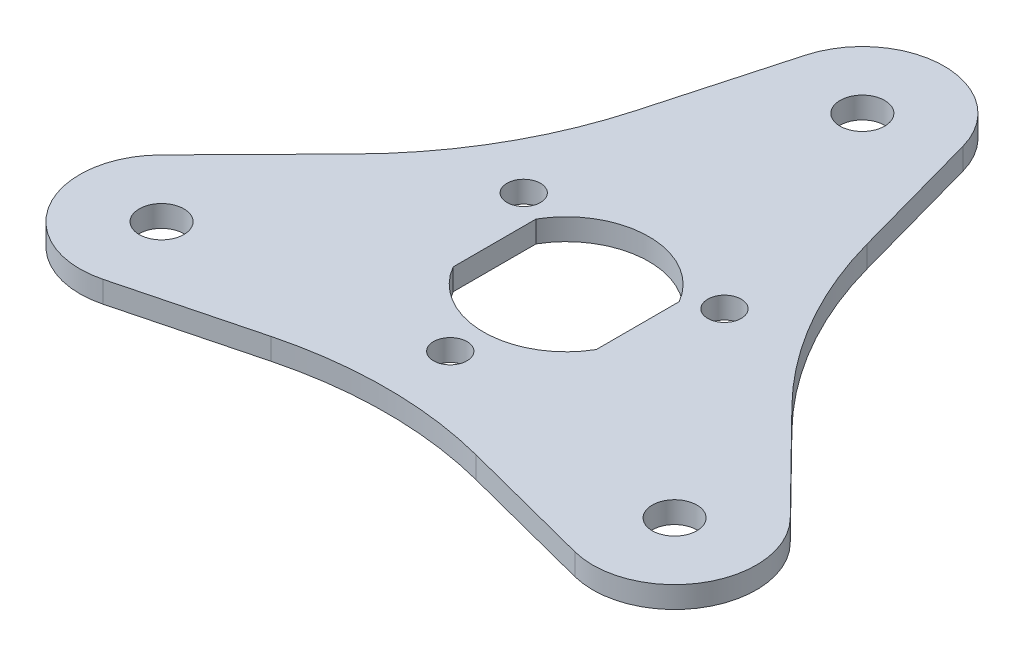
ISO-10303-21;
HEADER;
FILE_DESCRIPTION(('STEP AP214'),'2;1');
FILE_NAME('part.step','',(''),(''),'','','');
FILE_SCHEMA(('AUTOMOTIVE_DESIGN { 1 0 10303 214 1 1 1 1 }'));
ENDSEC;
DATA;
#1=APPLICATION_CONTEXT('core data for automotive mechanical design processes');
#2=APPLICATION_PROTOCOL_DEFINITION('international standard','automotive_design',2000,#1);
#3=PRODUCT_CONTEXT('',#1,'mechanical');
#4=PRODUCT('Part','Part','',(#3));
#5=PRODUCT_RELATED_PRODUCT_CATEGORY('part','',(#4));
#6=PRODUCT_DEFINITION_FORMATION('','',#4);
#7=PRODUCT_DEFINITION_CONTEXT('part definition',#1,'design');
#8=PRODUCT_DEFINITION('design','',#6,#7);
#9=PRODUCT_DEFINITION_SHAPE('','',#8);
#10=(LENGTH_UNIT() NAMED_UNIT(*) SI_UNIT(.MILLI.,.METRE.));
#11=(NAMED_UNIT(*) PLANE_ANGLE_UNIT() SI_UNIT($,.RADIAN.));
#12=(NAMED_UNIT(*) SI_UNIT($,.STERADIAN.) SOLID_ANGLE_UNIT());
#13=UNCERTAINTY_MEASURE_WITH_UNIT(LENGTH_MEASURE(1.E-05),#10,'distance_accuracy_value','');
#14=(GEOMETRIC_REPRESENTATION_CONTEXT(3) GLOBAL_UNCERTAINTY_ASSIGNED_CONTEXT((#13)) GLOBAL_UNIT_ASSIGNED_CONTEXT((#10,
#11,#12)) REPRESENTATION_CONTEXT('',''));
#15=CARTESIAN_POINT('',(0.,0.,0.));
#16=DIRECTION('',(0.,0.,1.));
#17=DIRECTION('',(1.,0.,0.));
#18=AXIS2_PLACEMENT_3D('',#15,#16,#17);
#19=CARTESIAN_POINT('',(15.4282314707645,2.9,-15.1689822139716));
#20=DIRECTION('',(-0.713072479631983,0.,0.701090321421923));
#21=DIRECTION('',(0.701090321421923,0.,0.713072479631983));
#22=AXIS2_PLACEMENT_3D('',#19,#20,#21);
#23=PLANE('',#22);
#24=DIRECTION('',(-0.701090321421924,0.,-0.713072479631983));
#25=VECTOR('',#24,1.);
#26=CARTESIAN_POINT('',(15.4282314707645,0.,-15.1689822139716));
#27=LINE('',#26,#25);
#28=CARTESIAN_POINT('',(42.3437972759519,0.,12.206590751401));
#29=VERTEX_POINT('',#28);
#30=CARTESIAN_POINT('',(29.3380366705896,0.,-1.02144803475147));
#31=VERTEX_POINT('',#30);
#32=EDGE_CURVE('E235',#29,#31,#27,.T.);
#33=ORIENTED_EDGE('',*,*,#32,.T.);
#34=DIRECTION('',(0.,-1.,0.));
#35=VECTOR('',#34,1.);
#36=CARTESIAN_POINT('',(29.3380366705896,2.9,-1.02144803475147));
#37=LINE('',#36,#35);
#38=CARTESIAN_POINT('',(29.3380366705896,2.9,-1.02144803475147));
#39=VERTEX_POINT('',#38);
#40=EDGE_CURVE('E11',#39,#31,#37,.T.);
#41=ORIENTED_EDGE('',*,*,#40,.F.);
#42=DIRECTION('',(-0.701090321421924,0.,-0.713072479631983));
#43=VECTOR('',#42,1.);
#44=CARTESIAN_POINT('',(15.4282314707645,2.9,-15.1689822139716));
#45=LINE('',#44,#43);
#46=CARTESIAN_POINT('',(42.3437972759519,2.9,12.206590751401));
#47=VERTEX_POINT('',#46);
#48=EDGE_CURVE('E469',#47,#39,#45,.T.);
#49=ORIENTED_EDGE('',*,*,#48,.F.);
#50=DIRECTION('',(0.,-1.,0.));
#51=VECTOR('',#50,1.);
#52=CARTESIAN_POINT('',(42.3437972759519,2.9,12.206590751401));
#53=LINE('',#52,#51);
#54=EDGE_CURVE('E282',#47,#29,#53,.T.);
#55=ORIENTED_EDGE('',*,*,#54,.T.);
#56=EDGE_LOOP('',(#33,#41,#49,#55));
#57=FACE_BOUND('',#56,.T.);
#58=ADVANCED_FACE('F41',(#57),#23,.F.);
#59=CARTESIAN_POINT('',(68.5570230503486,2.9,-39.5814157129573));
#60=DIRECTION('',(0.,-1.,0.));
#61=DIRECTION('',(0.,0.,-1.));
#62=AXIS2_PLACEMENT_3D('',#59,#60,#61);
#63=CYLINDRICAL_SURFACE('',#62,55.);
#64=CARTESIAN_POINT('',(68.5570230503486,0.,-39.5814157129573));
#65=DIRECTION('',(0.,1.,0.));
#66=DIRECTION('',(0.,0.,1.));
#67=AXIS2_PLACEMENT_3D('',#64,#65,#66);
#68=CIRCLE('',#67,55.);
#69=CARTESIAN_POINT('',(15.5536182820357,0.,-24.896761036514));
#70=VERTEX_POINT('',#69);
#71=EDGE_CURVE('E239',#31,#70,#68,.F.);
#72=ORIENTED_EDGE('',*,*,#71,.T.);
#73=DIRECTION('',(0.,-1.,0.));
#74=VECTOR('',#73,1.);
#75=CARTESIAN_POINT('',(15.5536182820357,2.9,-24.896761036514));
#76=LINE('',#75,#74);
#77=CARTESIAN_POINT('',(15.5536182820357,2.9,-24.896761036514));
#78=VERTEX_POINT('',#77);
#79=EDGE_CURVE('E52',#78,#70,#76,.T.);
#80=ORIENTED_EDGE('',*,*,#79,.F.);
#81=CARTESIAN_POINT('',(68.5570230503486,2.9,-39.5814157129573));
#82=DIRECTION('',(0.,1.,0.));
#83=DIRECTION('',(0.,0.,1.));
#84=AXIS2_PLACEMENT_3D('',#81,#82,#83);
#85=CIRCLE('',#84,55.);
#86=EDGE_CURVE('E471',#39,#78,#85,.F.);
#87=ORIENTED_EDGE('',*,*,#86,.F.);
#88=ORIENTED_EDGE('',*,*,#40,.T.);
#89=EDGE_LOOP('',(#72,#80,#87,#88));
#90=FACE_BOUND('',#89,.T.);
#91=ADVANCED_FACE('F355',(#90),#63,.F.);
#92=CARTESIAN_POINT('',(20.8508396822361,2.9,-5.77674928216247));
#93=DIRECTION('',(-0.963698268514779,0.,0.266993721389879));
#94=DIRECTION('',(0.266993721389879,0.,0.963698268514779));
#95=AXIS2_PLACEMENT_3D('',#92,#93,#94);
#96=PLANE('',#95);
#97=DIRECTION('',(-0.266993721389879,0.,-0.963698268514779));
#98=VECTOR('',#97,1.);
#99=CARTESIAN_POINT('',(20.8508396822361,0.,-5.77674928216247));
#100=LINE('',#99,#98);
#101=CARTESIAN_POINT('',(10.6006809536628,0.,-42.7740995093728));
#102=VERTEX_POINT('',#101);
#103=EDGE_CURVE('E242',#70,#102,#100,.T.);
#104=ORIENTED_EDGE('',*,*,#103,.T.);
#105=DIRECTION('',(0.,-1.,0.));
#106=VECTOR('',#105,1.);
#107=CARTESIAN_POINT('',(10.6006809536628,2.9,-42.7740995093728));
#108=LINE('',#107,#106);
#109=CARTESIAN_POINT('',(10.6006809536628,2.9,-42.7740995093728));
#110=VERTEX_POINT('',#109);
#111=EDGE_CURVE('E309',#110,#102,#108,.T.);
#112=ORIENTED_EDGE('',*,*,#111,.F.);
#113=DIRECTION('',(-0.266993721389879,0.,-0.963698268514779));
#114=VECTOR('',#113,1.);
#115=CARTESIAN_POINT('',(20.8508396822361,2.9,-5.77674928216247));
#116=LINE('',#115,#114);
#117=EDGE_CURVE('E476',#78,#110,#116,.T.);
#118=ORIENTED_EDGE('',*,*,#117,.F.);
#119=ORIENTED_EDGE('',*,*,#79,.T.);
#120=EDGE_LOOP('',(#104,#112,#118,#119));
#121=FACE_BOUND('',#120,.T.);
#122=ADVANCED_FACE('F361',(#121),#96,.F.);
#123=CARTESIAN_POINT('',(0.,2.9,-39.8371685740843));
#124=DIRECTION('',(0.,-1.,0.));
#125=DIRECTION('',(0.,0.,-1.));
#126=AXIS2_PLACEMENT_3D('',#123,#124,#125);
#127=CYLINDRICAL_SURFACE('',#126,11.);
#128=CARTESIAN_POINT('',(0.,0.,-39.8371685740843));
#129=DIRECTION('',(0.,1.,0.));
#130=DIRECTION('',(0.,0.,1.));
#131=AXIS2_PLACEMENT_3D('',#128,#129,#130);
#132=CIRCLE('',#131,11.);
#133=CARTESIAN_POINT('',(-10.6006809536624,0.,-42.774099509373));
#134=VERTEX_POINT('',#133);
#135=EDGE_CURVE('E245',#102,#134,#132,.T.);
#136=ORIENTED_EDGE('',*,*,#135,.T.);
#137=DIRECTION('',(0.,-1.,0.));
#138=VECTOR('',#137,1.);
#139=CARTESIAN_POINT('',(-10.6006809536624,2.9,-42.774099509373));
#140=LINE('',#139,#138);
#141=CARTESIAN_POINT('',(-10.6006809536624,2.9,-42.774099509373));
#142=VERTEX_POINT('',#141);
#143=EDGE_CURVE('E305',#142,#134,#140,.T.);
#144=ORIENTED_EDGE('',*,*,#143,.F.);
#145=CARTESIAN_POINT('',(0.,2.9,-39.8371685740843));
#146=DIRECTION('',(0.,1.,0.));
#147=DIRECTION('',(0.,0.,1.));
#148=AXIS2_PLACEMENT_3D('',#145,#146,#147);
#149=CIRCLE('',#148,11.);
#150=EDGE_CURVE('E437',#110,#142,#149,.T.);
#151=ORIENTED_EDGE('',*,*,#150,.F.);
#152=ORIENTED_EDGE('',*,*,#111,.T.);
#153=EDGE_LOOP('',(#136,#144,#151,#152));
#154=FACE_BOUND('',#153,.T.);
#155=ADVANCED_FACE('F421',(#154),#127,.T.);
#156=CARTESIAN_POINT('',(-20.850839682236,2.9,-5.77674928216277));
#157=DIRECTION('',(0.963698268514776,0.,0.266993721389892));
#158=DIRECTION('',(0.266993721389892,0.,-0.963698268514776));
#159=AXIS2_PLACEMENT_3D('',#156,#157,#158);
#160=PLANE('',#159);
#161=DIRECTION('',(-0.266993721389892,0.,0.963698268514776));
#162=VECTOR('',#161,1.);
#163=CARTESIAN_POINT('',(-20.850839682236,0.,-5.77674928216277));
#164=LINE('',#163,#162);
#165=CARTESIAN_POINT('',(-15.5536182820354,0.,-24.8967610365142));
#166=VERTEX_POINT('',#165);
#167=EDGE_CURVE('E248',#134,#166,#164,.T.);
#168=ORIENTED_EDGE('',*,*,#167,.T.);
#169=DIRECTION('',(0.,-1.,0.));
#170=VECTOR('',#169,1.);
#171=CARTESIAN_POINT('',(-15.5536182820354,2.9,-24.8967610365142));
#172=LINE('',#171,#170);
#173=CARTESIAN_POINT('',(-15.5536182820354,2.9,-24.8967610365142));
#174=VERTEX_POINT('',#173);
#175=EDGE_CURVE('E301',#174,#166,#172,.T.);
#176=ORIENTED_EDGE('',*,*,#175,.F.);
#177=DIRECTION('',(-0.266993721389892,0.,0.963698268514776));
#178=VECTOR('',#177,1.);
#179=CARTESIAN_POINT('',(-20.850839682236,2.9,-5.77674928216277));
#180=LINE('',#179,#178);
#181=EDGE_CURVE('E451',#142,#174,#180,.T.);
#182=ORIENTED_EDGE('',*,*,#181,.F.);
#183=ORIENTED_EDGE('',*,*,#143,.T.);
#184=EDGE_LOOP('',(#168,#176,#182,#183));
#185=FACE_BOUND('',#184,.T.);
#186=ADVANCED_FACE('F417',(#185),#160,.F.);
#187=CARTESIAN_POINT('',(-68.557023050348,2.9,-39.5814157129582));
#188=DIRECTION('',(0.,-1.,0.));
#189=DIRECTION('',(0.,0.,-1.));
#190=AXIS2_PLACEMENT_3D('',#187,#188,#189);
#191=CYLINDRICAL_SURFACE('',#190,55.);
#192=CARTESIAN_POINT('',(-68.557023050348,0.,-39.5814157129582));
#193=DIRECTION('',(0.,1.,0.));
#194=DIRECTION('',(0.,0.,1.));
#195=AXIS2_PLACEMENT_3D('',#192,#193,#194);
#196=CIRCLE('',#195,55.);
#197=CARTESIAN_POINT('',(-29.3380366705896,0.,-1.02144803475187));
#198=VERTEX_POINT('',#197);
#199=EDGE_CURVE('E251',#166,#198,#196,.F.);
#200=ORIENTED_EDGE('',*,*,#199,.T.);
#201=DIRECTION('',(0.,-1.,0.));
#202=VECTOR('',#201,1.);
#203=CARTESIAN_POINT('',(-29.3380366705896,2.9,-1.02144803475187));
#204=LINE('',#203,#202);
#205=CARTESIAN_POINT('',(-29.3380366705896,2.9,-1.02144803475187));
#206=VERTEX_POINT('',#205);
#207=EDGE_CURVE('E297',#206,#198,#204,.T.);
#208=ORIENTED_EDGE('',*,*,#207,.F.);
#209=CARTESIAN_POINT('',(-68.557023050348,2.9,-39.5814157129582));
#210=DIRECTION('',(0.,1.,0.));
#211=DIRECTION('',(0.,0.,1.));
#212=AXIS2_PLACEMENT_3D('',#209,#210,#211);
#213=CIRCLE('',#212,55.);
#214=EDGE_CURVE('E447',#174,#206,#213,.F.);
#215=ORIENTED_EDGE('',*,*,#214,.F.);
#216=ORIENTED_EDGE('',*,*,#175,.T.);
#217=EDGE_LOOP('',(#200,#208,#215,#216));
#218=FACE_BOUND('',#217,.T.);
#219=ADVANCED_FACE('F413',(#218),#191,.F.);
#220=CARTESIAN_POINT('',(-15.4282314707643,2.9,-15.1689822139718));
#221=DIRECTION('',(0.713072479631973,0.,0.701090321421934));
#222=DIRECTION('',(0.701090321421934,0.,-0.713072479631973));
#223=AXIS2_PLACEMENT_3D('',#220,#221,#222);
#224=PLANE('',#223);
#225=DIRECTION('',(-0.701090321421934,0.,0.713072479631973));
#226=VECTOR('',#225,1.);
#227=CARTESIAN_POINT('',(-15.4282314707643,0.,-15.1689822139718));
#228=LINE('',#227,#226);
#229=CARTESIAN_POINT('',(-42.3437972759517,0.,12.2065907514008));
#230=VERTEX_POINT('',#229);
#231=EDGE_CURVE('E254',#198,#230,#228,.T.);
#232=ORIENTED_EDGE('',*,*,#231,.T.);
#233=DIRECTION('',(0.,-1.,0.));
#234=VECTOR('',#233,1.);
#235=CARTESIAN_POINT('',(-42.3437972759517,2.9,12.2065907514008));
#236=LINE('',#235,#234);
#237=CARTESIAN_POINT('',(-42.3437972759517,2.9,12.2065907514008));
#238=VERTEX_POINT('',#237);
#239=EDGE_CURVE('E293',#238,#230,#236,.T.);
#240=ORIENTED_EDGE('',*,*,#239,.F.);
#241=DIRECTION('',(-0.701090321421934,0.,0.713072479631973));
#242=VECTOR('',#241,1.);
#243=CARTESIAN_POINT('',(-15.4282314707643,2.9,-15.1689822139718));
#244=LINE('',#243,#242);
#245=EDGE_CURVE('E450',#206,#238,#244,.T.);
#246=ORIENTED_EDGE('',*,*,#245,.F.);
#247=ORIENTED_EDGE('',*,*,#207,.T.);
#248=EDGE_LOOP('',(#232,#240,#246,#247));
#249=FACE_BOUND('',#248,.T.);
#250=ADVANCED_FACE('F409',(#249),#224,.F.);
#251=CARTESIAN_POINT('',(-34.5,2.9,19.9185842870423));
#252=DIRECTION('',(0.,-1.,0.));
#253=DIRECTION('',(0.,0.,-1.));
#254=AXIS2_PLACEMENT_3D('',#251,#252,#253);
#255=CYLINDRICAL_SURFACE('',#254,11.);
#256=CARTESIAN_POINT('',(-34.5,0.,19.9185842870423));
#257=DIRECTION('',(0.,1.,0.));
#258=DIRECTION('',(0.,0.,1.));
#259=AXIS2_PLACEMENT_3D('',#256,#257,#258);
#260=CIRCLE('',#259,11.);
#261=CARTESIAN_POINT('',(-31.7431163222892,0.,30.5675087579722));
#262=VERTEX_POINT('',#261);
#263=EDGE_CURVE('E257',#230,#262,#260,.T.);
#264=ORIENTED_EDGE('',*,*,#263,.T.);
#265=DIRECTION('',(0.,-1.,0.));
#266=VECTOR('',#265,1.);
#267=CARTESIAN_POINT('',(-31.7431163222892,2.9,30.5675087579722));
#268=LINE('',#267,#266);
#269=CARTESIAN_POINT('',(-31.7431163222892,2.9,30.5675087579722));
#270=VERTEX_POINT('',#269);
#271=EDGE_CURVE('E289',#270,#262,#268,.T.);
#272=ORIENTED_EDGE('',*,*,#271,.F.);
#273=CARTESIAN_POINT('',(-34.5,2.9,19.9185842870423));
#274=DIRECTION('',(0.,1.,0.));
#275=DIRECTION('',(0.,0.,1.));
#276=AXIS2_PLACEMENT_3D('',#273,#274,#275);
#277=CIRCLE('',#276,11.);
#278=EDGE_CURVE('E455',#238,#270,#277,.T.);
#279=ORIENTED_EDGE('',*,*,#278,.F.);
#280=ORIENTED_EDGE('',*,*,#239,.T.);
#281=EDGE_LOOP('',(#264,#272,#279,#280));
#282=FACE_BOUND('',#281,.T.);
#283=ADVANCED_FACE('F405',(#282),#255,.T.);
#284=CARTESIAN_POINT('',(5.42260821147162,2.9,20.9457314961344));
#285=DIRECTION('',(-0.250625788882801,0.,-0.968084042811818));
#286=DIRECTION('',(-0.968084042811818,0.,0.250625788882801));
#287=AXIS2_PLACEMENT_3D('',#284,#285,#286);
#288=PLANE('',#287);
#289=DIRECTION('',(0.968084042811818,0.,-0.250625788882801));
#290=VECTOR('',#289,1.);
#291=CARTESIAN_POINT('',(5.42260821147162,0.,20.9457314961344));
#292=LINE('',#291,#290);
#293=CARTESIAN_POINT('',(-13.7844183885541,0.,25.9182090712659));
#294=VERTEX_POINT('',#293);
#295=EDGE_CURVE('E260',#262,#294,#292,.T.);
#296=ORIENTED_EDGE('',*,*,#295,.T.);
#297=DIRECTION('',(0.,-1.,0.));
#298=VECTOR('',#297,1.);
#299=CARTESIAN_POINT('',(-13.7844183885541,2.9,25.9182090712659));
#300=LINE('',#299,#298);
#301=CARTESIAN_POINT('',(-13.7844183885541,2.9,25.9182090712659));
#302=VERTEX_POINT('',#301);
#303=EDGE_CURVE('E184',#302,#294,#300,.T.);
#304=ORIENTED_EDGE('',*,*,#303,.F.);
#305=DIRECTION('',(0.968084042811818,0.,-0.250625788882801));
#306=VECTOR('',#305,1.);
#307=CARTESIAN_POINT('',(5.42260821147162,2.9,20.9457314961344));
#308=LINE('',#307,#306);
#309=EDGE_CURVE('E173',#270,#302,#308,.T.);
#310=ORIENTED_EDGE('',*,*,#309,.F.);
#311=ORIENTED_EDGE('',*,*,#271,.T.);
#312=EDGE_LOOP('',(#296,#304,#310,#311));
#313=FACE_BOUND('',#312,.T.);
#314=ADVANCED_FACE('F402',(#313),#288,.F.);
#315=CARTESIAN_POINT('',(0.,2.9,79.1628314259158));
#316=DIRECTION('',(0.,-1.,0.));
#317=DIRECTION('',(0.,0.,-1.));
#318=AXIS2_PLACEMENT_3D('',#315,#316,#317);
#319=CYLINDRICAL_SURFACE('',#318,55.);
#320=CARTESIAN_POINT('',(0.,0.,79.1628314259158));
#321=DIRECTION('',(0.,1.,0.));
#322=DIRECTION('',(0.,0.,1.));
#323=AXIS2_PLACEMENT_3D('',#320,#321,#322);
#324=CIRCLE('',#323,55.);
#325=CARTESIAN_POINT('',(13.7844183885541,0.,25.9182090712659));
#326=VERTEX_POINT('',#325);
#327=EDGE_CURVE('E182',#294,#326,#324,.F.);
#328=ORIENTED_EDGE('',*,*,#327,.T.);
#329=DIRECTION('',(0.,-1.,0.));
#330=VECTOR('',#329,1.);
#331=CARTESIAN_POINT('',(13.7844183885541,2.9,25.9182090712659));
#332=LINE('',#331,#330);
#333=CARTESIAN_POINT('',(13.7844183885541,2.9,25.9182090712659));
#334=VERTEX_POINT('',#333);
#335=EDGE_CURVE('E179',#334,#326,#332,.T.);
#336=ORIENTED_EDGE('',*,*,#335,.F.);
#337=CARTESIAN_POINT('',(0.,2.9,79.1628314259158));
#338=DIRECTION('',(0.,1.,0.));
#339=DIRECTION('',(0.,0.,1.));
#340=AXIS2_PLACEMENT_3D('',#337,#338,#339);
#341=CIRCLE('',#340,55.);
#342=EDGE_CURVE('E166',#302,#334,#341,.F.);
#343=ORIENTED_EDGE('',*,*,#342,.F.);
#344=ORIENTED_EDGE('',*,*,#303,.T.);
#345=EDGE_LOOP('',(#328,#336,#343,#344));
#346=FACE_BOUND('',#345,.T.);
#347=ADVANCED_FACE('F180',(#346),#319,.F.);
#348=CARTESIAN_POINT('',(-5.42260821147162,2.9,20.9457314961344));
#349=DIRECTION('',(0.250625788882801,0.,-0.968084042811818));
#350=DIRECTION('',(-0.968084042811818,0.,-0.250625788882801));
#351=AXIS2_PLACEMENT_3D('',#348,#349,#350);
#352=PLANE('',#351);
#353=DIRECTION('',(0.968084042811818,0.,0.250625788882801));
#354=VECTOR('',#353,1.);
#355=CARTESIAN_POINT('',(-5.42260821147162,0.,20.9457314961344));
#356=LINE('',#355,#354);
#357=CARTESIAN_POINT('',(31.7431163222892,0.,30.5675087579719));
#358=VERTEX_POINT('',#357);
#359=EDGE_CURVE('E114',#326,#358,#356,.T.);
#360=ORIENTED_EDGE('',*,*,#359,.T.);
#361=DIRECTION('',(0.,-1.,0.));
#362=VECTOR('',#361,1.);
#363=CARTESIAN_POINT('',(31.7431163222892,2.9,30.5675087579719));
#364=LINE('',#363,#362);
#365=CARTESIAN_POINT('',(31.7431163222892,2.9,30.5675087579719));
#366=VERTEX_POINT('',#365);
#367=EDGE_CURVE('E185',#366,#358,#364,.T.);
#368=ORIENTED_EDGE('',*,*,#367,.F.);
#369=DIRECTION('',(0.968084042811818,0.,0.250625788882801));
#370=VECTOR('',#369,1.);
#371=CARTESIAN_POINT('',(-5.42260821147162,2.9,20.9457314961344));
#372=LINE('',#371,#370);
#373=EDGE_CURVE('E171',#334,#366,#372,.T.);
#374=ORIENTED_EDGE('',*,*,#373,.F.);
#375=ORIENTED_EDGE('',*,*,#335,.T.);
#376=EDGE_LOOP('',(#360,#368,#374,#375));
#377=FACE_BOUND('',#376,.T.);
#378=ADVANCED_FACE('F187',(#377),#352,.F.);
#379=CARTESIAN_POINT('',(0.,2.9,0.));
#380=DIRECTION('',(0.,-1.,0.));
#381=DIRECTION('',(0.,0.,-1.));
#382=AXIS2_PLACEMENT_3D('',#379,#380,#381);
#383=CYLINDRICAL_SURFACE('',#382,11.125);
#384=CARTESIAN_POINT('',(0.,0.,0.));
#385=DIRECTION('',(0.,1.,0.));
#386=DIRECTION('',(0.,0.,1.));
#387=AXIS2_PLACEMENT_3D('',#384,#385,#386);
#388=CIRCLE('',#387,11.125);
#389=CARTESIAN_POINT('',(9.62500000000001,0.,-5.57897840110534));
#390=VERTEX_POINT('',#389);
#391=CARTESIAN_POINT('',(-9.62500000000001,0.,-5.57897840110534));
#392=VERTEX_POINT('',#391);
#393=EDGE_CURVE('E207',#390,#392,#388,.T.);
#394=ORIENTED_EDGE('',*,*,#393,.F.);
#395=DIRECTION('',(0.,-1.,0.));
#396=VECTOR('',#395,1.);
#397=CARTESIAN_POINT('',(9.62500000000001,2.9,-5.57897840110534));
#398=LINE('',#397,#396);
#399=CARTESIAN_POINT('',(9.62500000000001,2.9,-5.57897840110534));
#400=VERTEX_POINT('',#399);
#401=EDGE_CURVE('E45',#400,#390,#398,.T.);
#402=ORIENTED_EDGE('',*,*,#401,.F.);
#403=CARTESIAN_POINT('',(0.,2.9,0.));
#404=DIRECTION('',(0.,1.,0.));
#405=DIRECTION('',(0.,0.,1.));
#406=AXIS2_PLACEMENT_3D('',#403,#404,#405);
#407=CIRCLE('',#406,11.125);
#408=CARTESIAN_POINT('',(-9.62500000000001,2.9,-5.57897840110534));
#409=VERTEX_POINT('',#408);
#410=EDGE_CURVE('E281',#400,#409,#407,.T.);
#411=ORIENTED_EDGE('',*,*,#410,.T.);
#412=DIRECTION('',(0.,-1.,0.));
#413=VECTOR('',#412,1.);
#414=CARTESIAN_POINT('',(-9.62500000000001,2.9,-5.57897840110534));
#415=LINE('',#414,#413);
#416=EDGE_CURVE('E206',#409,#392,#415,.T.);
#417=ORIENTED_EDGE('',*,*,#416,.T.);
#418=EDGE_LOOP('',(#394,#402,#411,#417));
#419=FACE_BOUND('',#418,.T.);
#420=ADVANCED_FACE('F43',(#419),#383,.F.);
#421=CARTESIAN_POINT('',(9.62500000000001,2.9,0.));
#422=DIRECTION('',(1.,0.,0.));
#423=DIRECTION('',(0.,0.,-1.));
#424=AXIS2_PLACEMENT_3D('',#421,#422,#423);
#425=PLANE('',#424);
#426=DIRECTION('',(0.,0.,1.));
#427=VECTOR('',#426,1.);
#428=CARTESIAN_POINT('',(9.62500000000001,0.,0.));
#429=LINE('',#428,#427);
#430=CARTESIAN_POINT('',(9.62500000000001,0.,5.57897840110534));
#431=VERTEX_POINT('',#430);
#432=EDGE_CURVE('E211',#390,#431,#429,.T.);
#433=ORIENTED_EDGE('',*,*,#432,.T.);
#434=DIRECTION('',(0.,-1.,0.));
#435=VECTOR('',#434,1.);
#436=CARTESIAN_POINT('',(9.62500000000001,2.9,5.57897840110534));
#437=LINE('',#436,#435);
#438=CARTESIAN_POINT('',(9.62500000000001,2.9,5.57897840110534));
#439=VERTEX_POINT('',#438);
#440=EDGE_CURVE('E320',#439,#431,#437,.T.);
#441=ORIENTED_EDGE('',*,*,#440,.F.);
#442=DIRECTION('',(0.,0.,1.));
#443=VECTOR('',#442,1.);
#444=CARTESIAN_POINT('',(9.62500000000001,2.9,0.));
#445=LINE('',#444,#443);
#446=EDGE_CURVE('E330',#400,#439,#445,.T.);
#447=ORIENTED_EDGE('',*,*,#446,.F.);
#448=ORIENTED_EDGE('',*,*,#401,.T.);
#449=EDGE_LOOP('',(#433,#441,#447,#448));
#450=FACE_BOUND('',#449,.T.);
#451=ADVANCED_FACE('F329',(#450),#425,.F.);
#452=CARTESIAN_POINT('',(0.,2.9,0.));
#453=DIRECTION('',(0.,-1.,0.));
#454=DIRECTION('',(0.,0.,-1.));
#455=AXIS2_PLACEMENT_3D('',#452,#453,#454);
#456=CYLINDRICAL_SURFACE('',#455,11.125);
#457=CARTESIAN_POINT('',(0.,0.,0.));
#458=DIRECTION('',(0.,1.,0.));
#459=DIRECTION('',(0.,0.,1.));
#460=AXIS2_PLACEMENT_3D('',#457,#458,#459);
#461=CIRCLE('',#460,11.125);
#462=CARTESIAN_POINT('',(-9.62500000000001,0.,5.57897840110534));
#463=VERTEX_POINT('',#462);
#464=EDGE_CURVE('E215',#463,#431,#461,.T.);
#465=ORIENTED_EDGE('',*,*,#464,.F.);
#466=DIRECTION('',(0.,-1.,0.));
#467=VECTOR('',#466,1.);
#468=CARTESIAN_POINT('',(-9.62500000000001,2.9,5.57897840110534));
#469=LINE('',#468,#467);
#470=CARTESIAN_POINT('',(-9.62500000000001,2.9,5.57897840110534));
#471=VERTEX_POINT('',#470);
#472=EDGE_CURVE('E318',#471,#463,#469,.T.);
#473=ORIENTED_EDGE('',*,*,#472,.F.);
#474=CARTESIAN_POINT('',(0.,2.9,0.));
#475=DIRECTION('',(0.,1.,0.));
#476=DIRECTION('',(0.,0.,1.));
#477=AXIS2_PLACEMENT_3D('',#474,#475,#476);
#478=CIRCLE('',#477,11.125);
#479=EDGE_CURVE('E494',#471,#439,#478,.T.);
#480=ORIENTED_EDGE('',*,*,#479,.T.);
#481=ORIENTED_EDGE('',*,*,#440,.T.);
#482=EDGE_LOOP('',(#465,#473,#480,#481));
#483=FACE_BOUND('',#482,.T.);
#484=ADVANCED_FACE('F342',(#483),#456,.F.);
#485=CARTESIAN_POINT('',(-34.5,2.9,19.9185842870423));
#486=DIRECTION('',(0.,-1.,0.));
#487=DIRECTION('',(0.,0.,-1.));
#488=AXIS2_PLACEMENT_3D('',#485,#486,#487);
#489=CYLINDRICAL_SURFACE('',#488,3.);
#490=CARTESIAN_POINT('',(-34.5,2.9,19.9185842870423));
#491=DIRECTION('',(0.,1.,0.));
#492=DIRECTION('',(0.,0.,1.));
#493=AXIS2_PLACEMENT_3D('',#490,#491,#492);
#494=CIRCLE('',#493,3.);
#495=CARTESIAN_POINT('',(-34.5,2.9,22.9185842870423));
#496=VERTEX_POINT('',#495);
#497=EDGE_CURVE('E198',#496,#496,#494,.T.);
#498=ORIENTED_EDGE('',*,*,#497,.T.);
#499=EDGE_LOOP('',(#498));
#500=FACE_BOUND('',#499,.T.);
#501=CARTESIAN_POINT('',(-34.5,0.,19.9185842870423));
#502=DIRECTION('',(0.,1.,0.));
#503=DIRECTION('',(0.,0.,1.));
#504=AXIS2_PLACEMENT_3D('',#501,#502,#503);
#505=CIRCLE('',#504,3.);
#506=CARTESIAN_POINT('',(-34.5,0.,22.9185842870423));
#507=VERTEX_POINT('',#506);
#508=EDGE_CURVE('E273',#507,#507,#505,.T.);
#509=ORIENTED_EDGE('',*,*,#508,.F.);
#510=EDGE_LOOP('',(#509));
#511=FACE_BOUND('',#510,.T.);
#512=ADVANCED_FACE('F344',(#500,#511),#489,.F.);
#513=CARTESIAN_POINT('',(34.5000000000003,2.9,19.9185842870418));
#514=DIRECTION('',(0.,-1.,0.));
#515=DIRECTION('',(0.,0.,-1.));
#516=AXIS2_PLACEMENT_3D('',#513,#514,#515);
#517=CYLINDRICAL_SURFACE('',#516,3.);
#518=CARTESIAN_POINT('',(34.5000000000003,2.9,19.9185842870418));
#519=DIRECTION('',(0.,1.,0.));
#520=DIRECTION('',(0.,0.,1.));
#521=AXIS2_PLACEMENT_3D('',#518,#519,#520);
#522=CIRCLE('',#521,3.);
#523=CARTESIAN_POINT('',(34.5000000000003,2.9,22.9185842870418));
#524=VERTEX_POINT('',#523);
#525=EDGE_CURVE('E191',#524,#524,#522,.T.);
#526=ORIENTED_EDGE('',*,*,#525,.T.);
#527=EDGE_LOOP('',(#526));
#528=FACE_BOUND('',#527,.T.);
#529=CARTESIAN_POINT('',(34.5000000000003,0.,19.9185842870418));
#530=DIRECTION('',(0.,1.,0.));
#531=DIRECTION('',(0.,0.,1.));
#532=AXIS2_PLACEMENT_3D('',#529,#530,#531);
#533=CIRCLE('',#532,3.);
#534=CARTESIAN_POINT('',(34.5000000000003,0.,22.9185842870418));
#535=VERTEX_POINT('',#534);
#536=EDGE_CURVE('E269',#535,#535,#533,.T.);
#537=ORIENTED_EDGE('',*,*,#536,.F.);
#538=EDGE_LOOP('',(#537));
#539=FACE_BOUND('',#538,.T.);
#540=ADVANCED_FACE('F350',(#528,#539),#517,.F.);
#541=CARTESIAN_POINT('',(34.5000000000003,2.9,19.9185842870418));
#542=DIRECTION('',(0.,-1.,0.));
#543=DIRECTION('',(0.,0.,-1.));
#544=AXIS2_PLACEMENT_3D('',#541,#542,#543);
#545=CYLINDRICAL_SURFACE('',#544,11.);
#546=CARTESIAN_POINT('',(34.5000000000003,0.,19.9185842870418));
#547=DIRECTION('',(0.,1.,0.));
#548=DIRECTION('',(0.,0.,1.));
#549=AXIS2_PLACEMENT_3D('',#546,#547,#548);
#550=CIRCLE('',#549,11.);
#551=EDGE_CURVE('E120',#358,#29,#550,.T.);
#552=ORIENTED_EDGE('',*,*,#551,.T.);
#553=ORIENTED_EDGE('',*,*,#54,.F.);
#554=CARTESIAN_POINT('',(34.5000000000003,2.9,19.9185842870418));
#555=DIRECTION('',(0.,1.,0.));
#556=DIRECTION('',(0.,0.,1.));
#557=AXIS2_PLACEMENT_3D('',#554,#555,#556);
#558=CIRCLE('',#557,11.);
#559=EDGE_CURVE('E61',#366,#47,#558,.T.);
#560=ORIENTED_EDGE('',*,*,#559,.F.);
#561=ORIENTED_EDGE('',*,*,#367,.T.);
#562=EDGE_LOOP('',(#552,#553,#560,#561));
#563=FACE_BOUND('',#562,.T.);
#564=ADVANCED_FACE('F370',(#563),#545,.T.);
#565=CARTESIAN_POINT('',(13.5,2.9,-7.79422863405995));
#566=DIRECTION('',(0.,-1.,0.));
#567=DIRECTION('',(0.,0.,-1.));
#568=AXIS2_PLACEMENT_3D('',#565,#566,#567);
#569=CYLINDRICAL_SURFACE('',#568,2.25);
#570=CARTESIAN_POINT('',(13.5,2.9,-7.79422863405995));
#571=DIRECTION('',(0.,1.,0.));
#572=DIRECTION('',(0.,0.,1.));
#573=AXIS2_PLACEMENT_3D('',#570,#571,#572);
#574=CIRCLE('',#573,2.25);
#575=CARTESIAN_POINT('',(13.5,2.9,-5.54422863405995));
#576=VERTEX_POINT('',#575);
#577=EDGE_CURVE('E472',#576,#576,#574,.T.);
#578=ORIENTED_EDGE('',*,*,#577,.T.);
#579=EDGE_LOOP('',(#578));
#580=FACE_BOUND('',#579,.T.);
#581=CARTESIAN_POINT('',(13.5,0.,-7.79422863405995));
#582=DIRECTION('',(0.,1.,0.));
#583=DIRECTION('',(0.,0.,1.));
#584=AXIS2_PLACEMENT_3D('',#581,#582,#583);
#585=CIRCLE('',#584,2.25);
#586=CARTESIAN_POINT('',(13.5,0.,-5.54422863405995));
#587=VERTEX_POINT('',#586);
#588=EDGE_CURVE('E231',#587,#587,#585,.T.);
#589=ORIENTED_EDGE('',*,*,#588,.F.);
#590=EDGE_LOOP('',(#589));
#591=FACE_BOUND('',#590,.T.);
#592=ADVANCED_FACE('F366',(#580,#591),#569,.F.);
#593=CARTESIAN_POINT('',(-13.5,2.9,-7.79422863405995));
#594=DIRECTION('',(0.,-1.,0.));
#595=DIRECTION('',(0.,0.,-1.));
#596=AXIS2_PLACEMENT_3D('',#593,#594,#595);
#597=CYLINDRICAL_SURFACE('',#596,2.25);
#598=CARTESIAN_POINT('',(-13.5,2.9,-7.79422863405995));
#599=DIRECTION('',(0.,1.,0.));
#600=DIRECTION('',(0.,0.,1.));
#601=AXIS2_PLACEMENT_3D('',#598,#599,#600);
#602=CIRCLE('',#601,2.25);
#603=CARTESIAN_POINT('',(-13.5,2.9,-5.54422863405995));
#604=VERTEX_POINT('',#603);
#605=EDGE_CURVE('E479',#604,#604,#602,.T.);
#606=ORIENTED_EDGE('',*,*,#605,.T.);
#607=EDGE_LOOP('',(#606));
#608=FACE_BOUND('',#607,.T.);
#609=CARTESIAN_POINT('',(-13.5,0.,-7.79422863405995));
#610=DIRECTION('',(0.,1.,0.));
#611=DIRECTION('',(0.,0.,1.));
#612=AXIS2_PLACEMENT_3D('',#609,#610,#611);
#613=CIRCLE('',#612,2.25);
#614=CARTESIAN_POINT('',(-13.5,0.,-5.54422863405995));
#615=VERTEX_POINT('',#614);
#616=EDGE_CURVE('E227',#615,#615,#613,.T.);
#617=ORIENTED_EDGE('',*,*,#616,.F.);
#618=EDGE_LOOP('',(#617));
#619=FACE_BOUND('',#618,.T.);
#620=ADVANCED_FACE('F369',(#608,#619),#597,.F.);
#621=CARTESIAN_POINT('',(0.,2.9,15.5884572681199));
#622=DIRECTION('',(0.,-1.,0.));
#623=DIRECTION('',(0.,0.,-1.));
#624=AXIS2_PLACEMENT_3D('',#621,#622,#623);
#625=CYLINDRICAL_SURFACE('',#624,2.25);
#626=CARTESIAN_POINT('',(0.,2.9,15.5884572681199));
#627=DIRECTION('',(0.,1.,0.));
#628=DIRECTION('',(0.,0.,1.));
#629=AXIS2_PLACEMENT_3D('',#626,#627,#628);
#630=CIRCLE('',#629,2.25);
#631=CARTESIAN_POINT('',(0.,2.9,17.8384572681199));
#632=VERTEX_POINT('',#631);
#633=EDGE_CURVE('E488',#632,#632,#630,.T.);
#634=ORIENTED_EDGE('',*,*,#633,.T.);
#635=EDGE_LOOP('',(#634));
#636=FACE_BOUND('',#635,.T.);
#637=CARTESIAN_POINT('',(0.,0.,15.5884572681199));
#638=DIRECTION('',(0.,1.,0.));
#639=DIRECTION('',(0.,0.,1.));
#640=AXIS2_PLACEMENT_3D('',#637,#638,#639);
#641=CIRCLE('',#640,2.25);
#642=CARTESIAN_POINT('',(0.,0.,17.8384572681199));
#643=VERTEX_POINT('',#642);
#644=EDGE_CURVE('E223',#643,#643,#641,.T.);
#645=ORIENTED_EDGE('',*,*,#644,.F.);
#646=EDGE_LOOP('',(#645));
#647=FACE_BOUND('',#646,.T.);
#648=ADVANCED_FACE('F374',(#636,#647),#625,.F.);
#649=CARTESIAN_POINT('',(-9.62500000000001,2.9,0.));
#650=DIRECTION('',(1.,0.,0.));
#651=DIRECTION('',(0.,0.,-1.));
#652=AXIS2_PLACEMENT_3D('',#649,#650,#651);
#653=PLANE('',#652);
#654=DIRECTION('',(0.,0.,1.));
#655=VECTOR('',#654,1.);
#656=CARTESIAN_POINT('',(-9.62500000000001,0.,0.));
#657=LINE('',#656,#655);
#658=EDGE_CURVE('E219',#392,#463,#657,.T.);
#659=ORIENTED_EDGE('',*,*,#658,.F.);
#660=ORIENTED_EDGE('',*,*,#416,.F.);
#661=DIRECTION('',(0.,0.,1.));
#662=VECTOR('',#661,1.);
#663=CARTESIAN_POINT('',(-9.62500000000001,2.9,0.));
#664=LINE('',#663,#662);
#665=EDGE_CURVE('E340',#409,#471,#664,.T.);
#666=ORIENTED_EDGE('',*,*,#665,.T.);
#667=ORIENTED_EDGE('',*,*,#472,.T.);
#668=EDGE_LOOP('',(#659,#660,#666,#667));
#669=FACE_BOUND('',#668,.T.);
#670=ADVANCED_FACE('F339',(#669),#653,.T.);
#671=CARTESIAN_POINT('',(0.,2.9,-39.8371685740843));
#672=DIRECTION('',(0.,-1.,0.));
#673=DIRECTION('',(0.,0.,-1.));
#674=AXIS2_PLACEMENT_3D('',#671,#672,#673);
#675=CYLINDRICAL_SURFACE('',#674,3.);
#676=CARTESIAN_POINT('',(0.,2.9,-39.8371685740843));
#677=DIRECTION('',(0.,1.,0.));
#678=DIRECTION('',(0.,0.,1.));
#679=AXIS2_PLACEMENT_3D('',#676,#677,#678);
#680=CIRCLE('',#679,3.);
#681=CARTESIAN_POINT('',(0.,2.9,-36.8371685740843));
#682=VERTEX_POINT('',#681);
#683=EDGE_CURVE('E202',#682,#682,#680,.T.);
#684=ORIENTED_EDGE('',*,*,#683,.T.);
#685=EDGE_LOOP('',(#684));
#686=FACE_BOUND('',#685,.T.);
#687=CARTESIAN_POINT('',(0.,0.,-39.8371685740843));
#688=DIRECTION('',(0.,1.,0.));
#689=DIRECTION('',(0.,0.,1.));
#690=AXIS2_PLACEMENT_3D('',#687,#688,#689);
#691=CIRCLE('',#690,3.);
#692=CARTESIAN_POINT('',(0.,0.,-36.8371685740843));
#693=VERTEX_POINT('',#692);
#694=EDGE_CURVE('E277',#693,#693,#691,.T.);
#695=ORIENTED_EDGE('',*,*,#694,.F.);
#696=EDGE_LOOP('',(#695));
#697=FACE_BOUND('',#696,.T.);
#698=ADVANCED_FACE('F379',(#686,#697),#675,.F.);
#699=CARTESIAN_POINT('',(0.,2.9,0.));
#700=DIRECTION('',(0.,1.,0.));
#701=DIRECTION('',(0.,0.,1.));
#702=AXIS2_PLACEMENT_3D('',#699,#700,#701);
#703=PLANE('',#702);
#704=ORIENTED_EDGE('',*,*,#410,.F.);
#705=ORIENTED_EDGE('',*,*,#446,.T.);
#706=ORIENTED_EDGE('',*,*,#479,.F.);
#707=ORIENTED_EDGE('',*,*,#665,.F.);
#708=EDGE_LOOP('',(#704,#705,#706,#707));
#709=FACE_BOUND('',#708,.T.);
#710=ORIENTED_EDGE('',*,*,#633,.F.);
#711=EDGE_LOOP('',(#710));
#712=FACE_BOUND('',#711,.T.);
#713=ORIENTED_EDGE('',*,*,#605,.F.);
#714=EDGE_LOOP('',(#713));
#715=FACE_BOUND('',#714,.T.);
#716=ORIENTED_EDGE('',*,*,#577,.F.);
#717=EDGE_LOOP('',(#716));
#718=FACE_BOUND('',#717,.T.);
#719=ORIENTED_EDGE('',*,*,#48,.T.);
#720=ORIENTED_EDGE('',*,*,#86,.T.);
#721=ORIENTED_EDGE('',*,*,#117,.T.);
#722=ORIENTED_EDGE('',*,*,#150,.T.);
#723=ORIENTED_EDGE('',*,*,#181,.T.);
#724=ORIENTED_EDGE('',*,*,#214,.T.);
#725=ORIENTED_EDGE('',*,*,#245,.T.);
#726=ORIENTED_EDGE('',*,*,#278,.T.);
#727=ORIENTED_EDGE('',*,*,#309,.T.);
#728=ORIENTED_EDGE('',*,*,#342,.T.);
#729=ORIENTED_EDGE('',*,*,#373,.T.);
#730=ORIENTED_EDGE('',*,*,#559,.T.);
#731=EDGE_LOOP('',(#719,#720,#721,#722,#723,#724,#725,#726,#727,#728,#729,#730));
#732=FACE_BOUND('',#731,.T.);
#733=ORIENTED_EDGE('',*,*,#525,.F.);
#734=EDGE_LOOP('',(#733));
#735=FACE_BOUND('',#734,.T.);
#736=ORIENTED_EDGE('',*,*,#497,.F.);
#737=EDGE_LOOP('',(#736));
#738=FACE_BOUND('',#737,.T.);
#739=ORIENTED_EDGE('',*,*,#683,.F.);
#740=EDGE_LOOP('',(#739));
#741=FACE_BOUND('',#740,.T.);
#742=ADVANCED_FACE('F168',(#709,#712,#715,#718,#732,#735,#738,#741),#703,.T.);
#743=CARTESIAN_POINT('',(0.,0.,0.));
#744=DIRECTION('',(0.,1.,0.));
#745=DIRECTION('',(0.,0.,1.));
#746=AXIS2_PLACEMENT_3D('',#743,#744,#745);
#747=PLANE('',#746);
#748=ORIENTED_EDGE('',*,*,#393,.T.);
#749=ORIENTED_EDGE('',*,*,#658,.T.);
#750=ORIENTED_EDGE('',*,*,#464,.T.);
#751=ORIENTED_EDGE('',*,*,#432,.F.);
#752=EDGE_LOOP('',(#748,#749,#750,#751));
#753=FACE_BOUND('',#752,.T.);
#754=ORIENTED_EDGE('',*,*,#644,.T.);
#755=EDGE_LOOP('',(#754));
#756=FACE_BOUND('',#755,.T.);
#757=ORIENTED_EDGE('',*,*,#616,.T.);
#758=EDGE_LOOP('',(#757));
#759=FACE_BOUND('',#758,.T.);
#760=ORIENTED_EDGE('',*,*,#588,.T.);
#761=EDGE_LOOP('',(#760));
#762=FACE_BOUND('',#761,.T.);
#763=ORIENTED_EDGE('',*,*,#32,.F.);
#764=ORIENTED_EDGE('',*,*,#551,.F.);
#765=ORIENTED_EDGE('',*,*,#359,.F.);
#766=ORIENTED_EDGE('',*,*,#327,.F.);
#767=ORIENTED_EDGE('',*,*,#295,.F.);
#768=ORIENTED_EDGE('',*,*,#263,.F.);
#769=ORIENTED_EDGE('',*,*,#231,.F.);
#770=ORIENTED_EDGE('',*,*,#199,.F.);
#771=ORIENTED_EDGE('',*,*,#167,.F.);
#772=ORIENTED_EDGE('',*,*,#135,.F.);
#773=ORIENTED_EDGE('',*,*,#103,.F.);
#774=ORIENTED_EDGE('',*,*,#71,.F.);
#775=EDGE_LOOP('',(#763,#764,#765,#766,#767,#768,#769,#770,#771,#772,#773,#774));
#776=FACE_BOUND('',#775,.T.);
#777=ORIENTED_EDGE('',*,*,#536,.T.);
#778=EDGE_LOOP('',(#777));
#779=FACE_BOUND('',#778,.T.);
#780=ORIENTED_EDGE('',*,*,#508,.T.);
#781=EDGE_LOOP('',(#780));
#782=FACE_BOUND('',#781,.T.);
#783=ORIENTED_EDGE('',*,*,#694,.T.);
#784=EDGE_LOOP('',(#783));
#785=FACE_BOUND('',#784,.T.);
#786=ADVANCED_FACE('F333',(#753,#756,#759,#762,#776,#779,#782,#785),#747,.F.);
#787=CLOSED_SHELL('',(#58,#91,#122,#155,#186,#219,#250,#283,#314,#347,#378,#420,#451,#484,#512,
#540,#564,#592,#620,#648,#670,#698,#742,#786));
#788=MANIFOLD_SOLID_BREP('B2',#787);
#789=ADVANCED_BREP_SHAPE_REPRESENTATION('',(#18,#788),#14);
#790=SHAPE_DEFINITION_REPRESENTATION(#9,#789);
ENDSEC;
END-ISO-10303-21;
